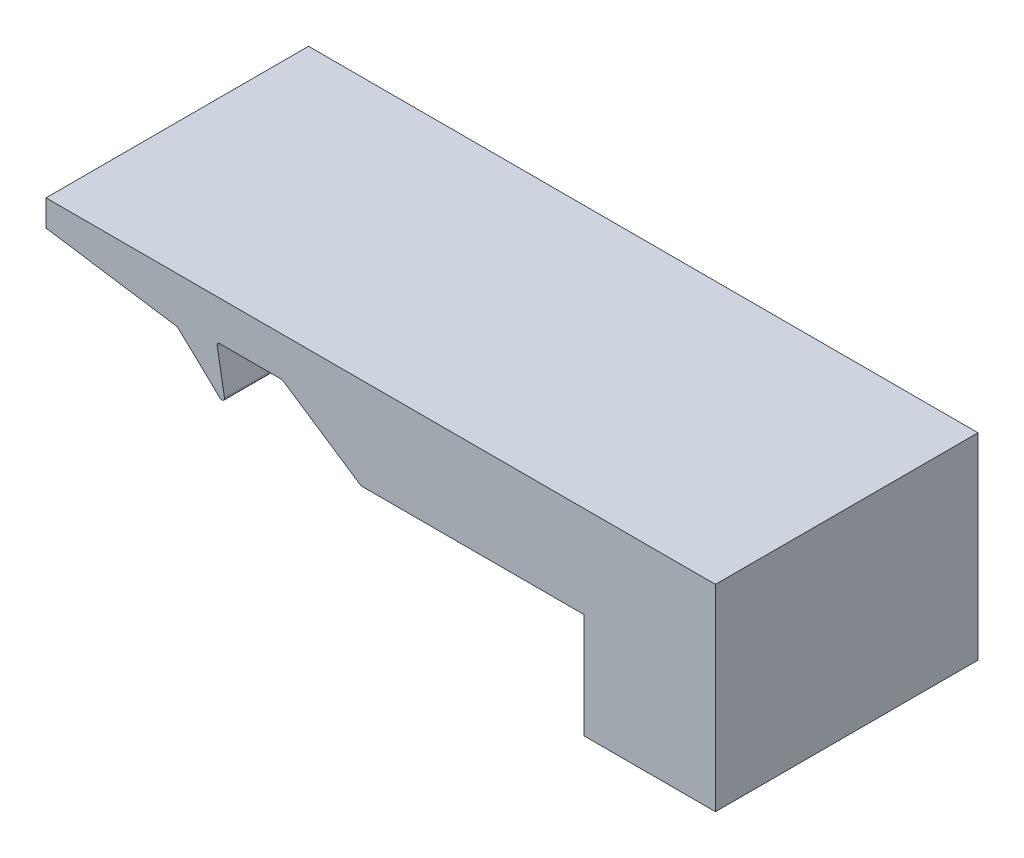
ISO-10303-21;
HEADER;
FILE_DESCRIPTION(('STEP AP214'),'2;1');
FILE_NAME('part.step','',(''),(''),'','','');
FILE_SCHEMA(('AUTOMOTIVE_DESIGN { 1 0 10303 214 1 1 1 1 }'));
ENDSEC;
DATA;
#1=APPLICATION_CONTEXT('core data for automotive mechanical design processes');
#2=APPLICATION_PROTOCOL_DEFINITION('international standard','automotive_design',2000,#1);
#3=PRODUCT_CONTEXT('',#1,'mechanical');
#4=PRODUCT('Part','Part','',(#3));
#5=PRODUCT_RELATED_PRODUCT_CATEGORY('part','',(#4));
#6=PRODUCT_DEFINITION_FORMATION('','',#4);
#7=PRODUCT_DEFINITION_CONTEXT('part definition',#1,'design');
#8=PRODUCT_DEFINITION('design','',#6,#7);
#9=PRODUCT_DEFINITION_SHAPE('','',#8);
#10=(LENGTH_UNIT() NAMED_UNIT(*) SI_UNIT(.MILLI.,.METRE.));
#11=(NAMED_UNIT(*) PLANE_ANGLE_UNIT() SI_UNIT($,.RADIAN.));
#12=(NAMED_UNIT(*) SI_UNIT($,.STERADIAN.) SOLID_ANGLE_UNIT());
#13=UNCERTAINTY_MEASURE_WITH_UNIT(LENGTH_MEASURE(1.E-05),#10,'distance_accuracy_value','');
#14=(GEOMETRIC_REPRESENTATION_CONTEXT(3) GLOBAL_UNCERTAINTY_ASSIGNED_CONTEXT((#13)) GLOBAL_UNIT_ASSIGNED_CONTEXT((#10,
#11,#12)) REPRESENTATION_CONTEXT('',''));
#15=CARTESIAN_POINT('',(0.,0.,0.));
#16=DIRECTION('',(0.,0.,1.));
#17=DIRECTION('',(1.,0.,0.));
#18=AXIS2_PLACEMENT_3D('',#15,#16,#17);
#19=CARTESIAN_POINT('',(-22.6448736499437,0.903160858228059,10.));
#20=DIRECTION('',(0.,1.,0.));
#21=DIRECTION('',(-1.,0.,0.));
#22=AXIS2_PLACEMENT_3D('',#19,#20,#21);
#23=PLANE('',#22);
#24=DIRECTION('',(1.,0.,0.));
#25=VECTOR('',#24,1.);
#26=CARTESIAN_POINT('',(-22.6448736499437,0.903160858228059,0.));
#27=LINE('',#26,#25);
#28=CARTESIAN_POINT('',(-31.1448736499437,0.903160858228059,0.));
#29=VERTEX_POINT('',#28);
#30=CARTESIAN_POINT('',(-22.6448736499437,0.903160858228059,0.));
#31=VERTEX_POINT('',#30);
#32=EDGE_CURVE('E173',#29,#31,#27,.T.);
#33=ORIENTED_EDGE('',*,*,#32,.T.);
#34=DIRECTION('',(0.,0.,-1.));
#35=VECTOR('',#34,1.);
#36=CARTESIAN_POINT('',(-22.6448736499437,0.903160858228059,10.));
#37=LINE('',#36,#35);
#38=CARTESIAN_POINT('',(-22.6448736499437,0.903160858228059,10.));
#39=VERTEX_POINT('',#38);
#40=EDGE_CURVE('E152',#39,#31,#37,.T.);
#41=ORIENTED_EDGE('',*,*,#40,.F.);
#42=DIRECTION('',(1.,0.,0.));
#43=VECTOR('',#42,1.);
#44=CARTESIAN_POINT('',(-22.6448736499437,0.903160858228059,10.));
#45=LINE('',#44,#43);
#46=CARTESIAN_POINT('',(-31.1448736499437,0.903160858228059,10.));
#47=VERTEX_POINT('',#46);
#48=EDGE_CURVE('E160',#47,#39,#45,.T.);
#49=ORIENTED_EDGE('',*,*,#48,.F.);
#50=DIRECTION('',(0.,0.,-1.));
#51=VECTOR('',#50,1.);
#52=CARTESIAN_POINT('',(-31.1448736499437,0.903160858228059,10.));
#53=LINE('',#52,#51);
#54=EDGE_CURVE('E243',#47,#29,#53,.T.);
#55=ORIENTED_EDGE('',*,*,#54,.T.);
#56=EDGE_LOOP('',(#33,#41,#49,#55));
#57=FACE_BOUND('',#56,.T.);
#58=ADVANCED_FACE('F45',(#57),#23,.F.);
#59=CARTESIAN_POINT('',(-22.6448736499437,-3.09683914177194,10.));
#60=DIRECTION('',(1.,0.,0.));
#61=DIRECTION('',(0.,0.,-1.));
#62=AXIS2_PLACEMENT_3D('',#59,#60,#61);
#63=PLANE('',#62);
#64=DIRECTION('',(0.,-1.,0.));
#65=VECTOR('',#64,1.);
#66=CARTESIAN_POINT('',(-22.6448736499437,-3.09683914177194,0.));
#67=LINE('',#66,#65);
#68=CARTESIAN_POINT('',(-22.6448736499437,-3.09683914177194,0.));
#69=VERTEX_POINT('',#68);
#70=EDGE_CURVE('E251',#31,#69,#67,.T.);
#71=ORIENTED_EDGE('',*,*,#70,.T.);
#72=DIRECTION('',(0.,0.,-1.));
#73=VECTOR('',#72,1.);
#74=CARTESIAN_POINT('',(-22.6448736499437,-3.09683914177194,10.));
#75=LINE('',#74,#73);
#76=CARTESIAN_POINT('',(-22.6448736499437,-3.09683914177194,10.));
#77=VERTEX_POINT('',#76);
#78=EDGE_CURVE('E155',#77,#69,#75,.T.);
#79=ORIENTED_EDGE('',*,*,#78,.F.);
#80=DIRECTION('',(0.,-1.,0.));
#81=VECTOR('',#80,1.);
#82=CARTESIAN_POINT('',(-22.6448736499437,-3.09683914177194,10.));
#83=LINE('',#82,#81);
#84=EDGE_CURVE('E148',#39,#77,#83,.T.);
#85=ORIENTED_EDGE('',*,*,#84,.F.);
#86=ORIENTED_EDGE('',*,*,#40,.T.);
#87=EDGE_LOOP('',(#71,#79,#85,#86));
#88=FACE_BOUND('',#87,.T.);
#89=ADVANCED_FACE('F150',(#88),#63,.F.);
#90=CARTESIAN_POINT('',(-17.6448736499437,-3.09683914177194,10.));
#91=DIRECTION('',(0.,1.,0.));
#92=DIRECTION('',(0.,0.,1.));
#93=AXIS2_PLACEMENT_3D('',#90,#91,#92);
#94=PLANE('',#93);
#95=DIRECTION('',(1.,0.,0.));
#96=VECTOR('',#95,1.);
#97=CARTESIAN_POINT('',(-17.6448736499437,-3.09683914177194,0.));
#98=LINE('',#97,#96);
#99=CARTESIAN_POINT('',(-17.6448736499437,-3.09683914177194,0.));
#100=VERTEX_POINT('',#99);
#101=EDGE_CURVE('E254',#69,#100,#98,.T.);
#102=ORIENTED_EDGE('',*,*,#101,.T.);
#103=DIRECTION('',(0.,0.,-1.));
#104=VECTOR('',#103,1.);
#105=CARTESIAN_POINT('',(-17.6448736499437,-3.09683914177194,10.));
#106=LINE('',#105,#104);
#107=CARTESIAN_POINT('',(-17.6448736499437,-3.09683914177194,10.));
#108=VERTEX_POINT('',#107);
#109=EDGE_CURVE('E182',#108,#100,#106,.T.);
#110=ORIENTED_EDGE('',*,*,#109,.F.);
#111=DIRECTION('',(1.,0.,0.));
#112=VECTOR('',#111,1.);
#113=CARTESIAN_POINT('',(-17.6448736499437,-3.09683914177194,10.));
#114=LINE('',#113,#112);
#115=EDGE_CURVE('E159',#77,#108,#114,.T.);
#116=ORIENTED_EDGE('',*,*,#115,.F.);
#117=ORIENTED_EDGE('',*,*,#78,.T.);
#118=EDGE_LOOP('',(#102,#110,#116,#117));
#119=FACE_BOUND('',#118,.T.);
#120=ADVANCED_FACE('F339',(#119),#94,.F.);
#121=CARTESIAN_POINT('',(-17.6448736499437,4.40316085822806,10.));
#122=DIRECTION('',(-1.,0.,0.));
#123=DIRECTION('',(0.,0.,1.));
#124=AXIS2_PLACEMENT_3D('',#121,#122,#123);
#125=PLANE('',#124);
#126=DIRECTION('',(0.,1.,0.));
#127=VECTOR('',#126,1.);
#128=CARTESIAN_POINT('',(-17.6448736499437,4.40316085822806,0.));
#129=LINE('',#128,#127);
#130=CARTESIAN_POINT('',(-17.6448736499437,4.40316085822806,0.));
#131=VERTEX_POINT('',#130);
#132=EDGE_CURVE('E257',#100,#131,#129,.T.);
#133=ORIENTED_EDGE('',*,*,#132,.T.);
#134=DIRECTION('',(0.,0.,-1.));
#135=VECTOR('',#134,1.);
#136=CARTESIAN_POINT('',(-17.6448736499437,4.40316085822806,10.));
#137=LINE('',#136,#135);
#138=CARTESIAN_POINT('',(-17.6448736499437,4.40316085822806,10.));
#139=VERTEX_POINT('',#138);
#140=EDGE_CURVE('E289',#139,#131,#137,.T.);
#141=ORIENTED_EDGE('',*,*,#140,.F.);
#142=DIRECTION('',(0.,1.,0.));
#143=VECTOR('',#142,1.);
#144=CARTESIAN_POINT('',(-17.6448736499437,4.40316085822806,10.));
#145=LINE('',#144,#143);
#146=EDGE_CURVE('E300',#108,#139,#145,.T.);
#147=ORIENTED_EDGE('',*,*,#146,.F.);
#148=ORIENTED_EDGE('',*,*,#109,.T.);
#149=EDGE_LOOP('',(#133,#141,#147,#148));
#150=FACE_BOUND('',#149,.T.);
#151=ADVANCED_FACE('F298',(#150),#125,.F.);
#152=CARTESIAN_POINT('',(-43.1448736499437,4.40316085822806,10.));
#153=DIRECTION('',(0.,-1.,0.));
#154=DIRECTION('',(1.,0.,0.));
#155=AXIS2_PLACEMENT_3D('',#152,#153,#154);
#156=PLANE('',#155);
#157=DIRECTION('',(-1.,0.,0.));
#158=VECTOR('',#157,1.);
#159=CARTESIAN_POINT('',(-43.1448736499437,4.40316085822806,0.));
#160=LINE('',#159,#158);
#161=CARTESIAN_POINT('',(-43.1448736499437,4.40316085822806,0.));
#162=VERTEX_POINT('',#161);
#163=EDGE_CURVE('E260',#131,#162,#160,.T.);
#164=ORIENTED_EDGE('',*,*,#163,.T.);
#165=DIRECTION('',(0.,0.,-1.));
#166=VECTOR('',#165,1.);
#167=CARTESIAN_POINT('',(-43.1448736499437,4.40316085822806,10.));
#168=LINE('',#167,#166);
#169=CARTESIAN_POINT('',(-43.1448736499437,4.40316085822806,10.));
#170=VERTEX_POINT('',#169);
#171=EDGE_CURVE('E285',#170,#162,#168,.T.);
#172=ORIENTED_EDGE('',*,*,#171,.F.);
#173=DIRECTION('',(-1.,0.,0.));
#174=VECTOR('',#173,1.);
#175=CARTESIAN_POINT('',(-43.1448736499437,4.40316085822806,10.));
#176=LINE('',#175,#174);
#177=EDGE_CURVE('E318',#139,#170,#176,.T.);
#178=ORIENTED_EDGE('',*,*,#177,.F.);
#179=ORIENTED_EDGE('',*,*,#140,.T.);
#180=EDGE_LOOP('',(#164,#172,#178,#179));
#181=FACE_BOUND('',#180,.T.);
#182=ADVANCED_FACE('F308',(#181),#156,.F.);
#183=CARTESIAN_POINT('',(-43.1448736499437,4.40316085822806,10.));
#184=DIRECTION('',(1.,0.,0.));
#185=DIRECTION('',(0.,0.,-1.));
#186=AXIS2_PLACEMENT_3D('',#183,#184,#185);
#187=PLANE('',#186);
#188=DIRECTION('',(0.,-1.,0.));
#189=VECTOR('',#188,1.);
#190=CARTESIAN_POINT('',(-43.1448736499437,4.40316085822806,0.));
#191=LINE('',#190,#189);
#192=CARTESIAN_POINT('',(-43.1448736499437,3.40316085822806,0.));
#193=VERTEX_POINT('',#192);
#194=EDGE_CURVE('E263',#162,#193,#191,.T.);
#195=ORIENTED_EDGE('',*,*,#194,.T.);
#196=DIRECTION('',(0.,0.,-1.));
#197=VECTOR('',#196,1.);
#198=CARTESIAN_POINT('',(-43.1448736499437,3.40316085822806,10.));
#199=LINE('',#198,#197);
#200=CARTESIAN_POINT('',(-43.1448736499437,3.40316085822806,10.));
#201=VERTEX_POINT('',#200);
#202=EDGE_CURVE('E281',#201,#193,#199,.T.);
#203=ORIENTED_EDGE('',*,*,#202,.F.);
#204=DIRECTION('',(0.,-1.,0.));
#205=VECTOR('',#204,1.);
#206=CARTESIAN_POINT('',(-43.1448736499437,4.40316085822806,10.));
#207=LINE('',#206,#205);
#208=EDGE_CURVE('E314',#170,#201,#207,.T.);
#209=ORIENTED_EDGE('',*,*,#208,.F.);
#210=ORIENTED_EDGE('',*,*,#171,.T.);
#211=EDGE_LOOP('',(#195,#203,#209,#210));
#212=FACE_BOUND('',#211,.T.);
#213=ADVANCED_FACE('F312',(#212),#187,.F.);
#214=CARTESIAN_POINT('',(-43.1448736499437,3.40316085822806,10.));
#215=DIRECTION('',(0.148340452930245,0.988936352868297,0.));
#216=DIRECTION('',(-0.988936352868298,0.148340452930245,0.));
#217=AXIS2_PLACEMENT_3D('',#214,#215,#216);
#218=PLANE('',#217);
#219=DIRECTION('',(0.988936352868298,-0.148340452930245,0.));
#220=VECTOR('',#219,1.);
#221=CARTESIAN_POINT('',(-43.1448736499437,3.40316085822806,0.));
#222=LINE('',#221,#220);
#223=CARTESIAN_POINT('',(-38.1448736499437,2.65316085822806,0.));
#224=VERTEX_POINT('',#223);
#225=EDGE_CURVE('E266',#193,#224,#222,.T.);
#226=ORIENTED_EDGE('',*,*,#225,.T.);
#227=DIRECTION('',(0.,0.,-1.));
#228=VECTOR('',#227,1.);
#229=CARTESIAN_POINT('',(-38.1448736499437,2.65316085822806,10.));
#230=LINE('',#229,#228);
#231=CARTESIAN_POINT('',(-38.1448736499437,2.65316085822806,10.));
#232=VERTEX_POINT('',#231);
#233=EDGE_CURVE('E277',#232,#224,#230,.T.);
#234=ORIENTED_EDGE('',*,*,#233,.F.);
#235=DIRECTION('',(0.988936352868298,-0.148340452930245,0.));
#236=VECTOR('',#235,1.);
#237=CARTESIAN_POINT('',(-43.1448736499437,3.40316085822806,10.));
#238=LINE('',#237,#236);
#239=EDGE_CURVE('E317',#201,#232,#238,.T.);
#240=ORIENTED_EDGE('',*,*,#239,.F.);
#241=ORIENTED_EDGE('',*,*,#202,.T.);
#242=EDGE_LOOP('',(#226,#234,#240,#241));
#243=FACE_BOUND('',#242,.T.);
#244=ADVANCED_FACE('F366',(#243),#218,.F.);
#245=CARTESIAN_POINT('',(-38.1448736499437,2.65316085822806,10.));
#246=DIRECTION('',(0.687098329534195,0.726564440054232,0.));
#247=DIRECTION('',(-0.726564440054232,0.687098329534195,0.));
#248=AXIS2_PLACEMENT_3D('',#245,#246,#247);
#249=PLANE('',#248);
#250=DIRECTION('',(0.726564440054232,-0.687098329534195,0.));
#251=VECTOR('',#250,1.);
#252=CARTESIAN_POINT('',(-38.1448736499437,2.65316085822806,0.));
#253=LINE('',#252,#251);
#254=CARTESIAN_POINT('',(-36.5136728496177,1.11056493245556,0.));
#255=VERTEX_POINT('',#254);
#256=EDGE_CURVE('E227',#224,#255,#253,.T.);
#257=ORIENTED_EDGE('',*,*,#256,.T.);
#258=DIRECTION('',(0.,0.,-1.));
#259=VECTOR('',#258,1.);
#260=CARTESIAN_POINT('',(-36.5136728496177,1.11056493245556,10.));
#261=LINE('',#260,#259);
#262=CARTESIAN_POINT('',(-36.5136728496177,1.11056493245556,10.));
#263=VERTEX_POINT('',#262);
#264=EDGE_CURVE('E61',#255,#263,#261,.F.);
#265=ORIENTED_EDGE('',*,*,#264,.T.);
#266=DIRECTION('',(0.726564440054232,-0.687098329534195,0.));
#267=VECTOR('',#266,1.);
#268=CARTESIAN_POINT('',(-38.1448736499437,2.65316085822806,10.));
#269=LINE('',#268,#267);
#270=EDGE_CURVE('E245',#232,#263,#269,.T.);
#271=ORIENTED_EDGE('',*,*,#270,.F.);
#272=ORIENTED_EDGE('',*,*,#233,.T.);
#273=EDGE_LOOP('',(#257,#265,#271,#272));
#274=FACE_BOUND('',#273,.T.);
#275=ADVANCED_FACE('F369',(#274),#249,.F.);
#276=CARTESIAN_POINT('',(-36.2943557321416,0.903160858228058,10.));
#277=DIRECTION('',(-0.984987125008186,-0.172627818059862,0.));
#278=DIRECTION('',(0.172627818059862,-0.984987125008186,0.));
#279=AXIS2_PLACEMENT_3D('',#276,#277,#278);
#280=PLANE('',#279);
#281=DIRECTION('',(-0.172627818059862,0.984987125008186,0.));
#282=VECTOR('',#281,1.);
#283=CARTESIAN_POINT('',(-36.2943557321416,0.903160858228058,0.));
#284=LINE('',#283,#282);
#285=CARTESIAN_POINT('',(-36.3464643041635,1.20048415826697,0.));
#286=VERTEX_POINT('',#285);
#287=CARTESIAN_POINT('',(-36.6243222968866,2.78589807642207,0.));
#288=VERTEX_POINT('',#287);
#289=EDGE_CURVE('E215',#286,#288,#284,.T.);
#290=ORIENTED_EDGE('',*,*,#289,.T.);
#291=DIRECTION('',(0.,0.,-1.));
#292=VECTOR('',#291,1.);
#293=CARTESIAN_POINT('',(-36.6243222968866,2.78589807642207,10.));
#294=LINE('',#293,#292);
#295=CARTESIAN_POINT('',(-36.6243222968866,2.78589807642207,10.));
#296=VERTEX_POINT('',#295);
#297=EDGE_CURVE('E196',#288,#296,#294,.F.);
#298=ORIENTED_EDGE('',*,*,#297,.T.);
#299=DIRECTION('',(-0.172627818059862,0.984987125008186,0.));
#300=VECTOR('',#299,1.);
#301=CARTESIAN_POINT('',(-36.2943557321416,0.903160858228058,10.));
#302=LINE('',#301,#300);
#303=CARTESIAN_POINT('',(-36.3464643041635,1.20048415826697,10.));
#304=VERTEX_POINT('',#303);
#305=EDGE_CURVE('E235',#304,#296,#302,.T.);
#306=ORIENTED_EDGE('',*,*,#305,.F.);
#307=DIRECTION('',(0.,0.,-1.));
#308=VECTOR('',#307,1.);
#309=CARTESIAN_POINT('',(-36.3464643041635,1.20048415826697,10.));
#310=LINE('',#309,#308);
#311=EDGE_CURVE('E192',#304,#286,#310,.T.);
#312=ORIENTED_EDGE('',*,*,#311,.T.);
#313=EDGE_LOOP('',(#290,#298,#306,#312));
#314=FACE_BOUND('',#313,.T.);
#315=ADVANCED_FACE('F222',(#314),#280,.F.);
#316=CARTESIAN_POINT('',(-34.1448736499437,2.90316085822806,10.));
#317=DIRECTION('',(0.,1.,0.));
#318=DIRECTION('',(0.,0.,1.));
#319=AXIS2_PLACEMENT_3D('',#316,#317,#318);
#320=PLANE('',#319);
#321=DIRECTION('',(1.,0.,0.));
#322=VECTOR('',#321,1.);
#323=CARTESIAN_POINT('',(-34.1448736499437,2.90316085822806,0.));
#324=LINE('',#323,#322);
#325=CARTESIAN_POINT('',(-36.5258235843857,2.90316085822806,0.));
#326=VERTEX_POINT('',#325);
#327=CARTESIAN_POINT('',(-34.1751512137169,2.90316085822806,0.));
#328=VERTEX_POINT('',#327);
#329=EDGE_CURVE('E217',#326,#328,#324,.T.);
#330=ORIENTED_EDGE('',*,*,#329,.T.);
#331=DIRECTION('',(0.,0.,-1.));
#332=VECTOR('',#331,1.);
#333=CARTESIAN_POINT('',(-34.1751512137169,2.90316085822806,10.));
#334=LINE('',#333,#332);
#335=CARTESIAN_POINT('',(-34.1751512137169,2.90316085822806,10.));
#336=VERTEX_POINT('',#335);
#337=EDGE_CURVE('E189',#328,#336,#334,.F.);
#338=ORIENTED_EDGE('',*,*,#337,.T.);
#339=DIRECTION('',(1.,0.,0.));
#340=VECTOR('',#339,1.);
#341=CARTESIAN_POINT('',(-34.1448736499437,2.90316085822806,10.));
#342=LINE('',#341,#340);
#343=CARTESIAN_POINT('',(-36.5258235843857,2.90316085822806,10.));
#344=VERTEX_POINT('',#343);
#345=EDGE_CURVE('E233',#344,#336,#342,.T.);
#346=ORIENTED_EDGE('',*,*,#345,.F.);
#347=DIRECTION('',(0.,0.,-1.));
#348=VECTOR('',#347,1.);
#349=CARTESIAN_POINT('',(-36.5258235843857,2.90316085822806,0.));
#350=LINE('',#349,#348);
#351=EDGE_CURVE('E180',#344,#326,#350,.T.);
#352=ORIENTED_EDGE('',*,*,#351,.T.);
#353=EDGE_LOOP('',(#330,#338,#346,#352));
#354=FACE_BOUND('',#353,.T.);
#355=ADVANCED_FACE('F237',(#354),#320,.F.);
#356=CARTESIAN_POINT('',(-31.1448736499437,0.903160858228059,10.));
#357=DIRECTION('',(0.554700196225229,0.832050294337844,0.));
#358=DIRECTION('',(-0.832050294337844,0.554700196225229,0.));
#359=AXIS2_PLACEMENT_3D('',#356,#357,#358);
#360=PLANE('',#359);
#361=DIRECTION('',(0.832050294337844,-0.554700196225229,0.));
#362=VECTOR('',#361,1.);
#363=CARTESIAN_POINT('',(-31.1448736499437,0.903160858228059,10.));
#364=LINE('',#363,#362);
#365=CARTESIAN_POINT('',(-34.1196811940944,2.88636588766185,10.));
#366=VERTEX_POINT('',#365);
#367=EDGE_CURVE('E165',#366,#47,#364,.T.);
#368=ORIENTED_EDGE('',*,*,#367,.F.);
#369=DIRECTION('',(0.,0.,-1.));
#370=VECTOR('',#369,1.);
#371=CARTESIAN_POINT('',(-34.1196811940944,2.88636588766185,0.));
#372=LINE('',#371,#370);
#373=CARTESIAN_POINT('',(-34.1196811940944,2.88636588766185,0.));
#374=VERTEX_POINT('',#373);
#375=EDGE_CURVE('E175',#366,#374,#372,.T.);
#376=ORIENTED_EDGE('',*,*,#375,.T.);
#377=DIRECTION('',(0.832050294337844,-0.554700196225229,0.));
#378=VECTOR('',#377,1.);
#379=CARTESIAN_POINT('',(-31.1448736499437,0.903160858228059,0.));
#380=LINE('',#379,#378);
#381=EDGE_CURVE('E170',#374,#29,#380,.T.);
#382=ORIENTED_EDGE('',*,*,#381,.T.);
#383=ORIENTED_EDGE('',*,*,#54,.F.);
#384=EDGE_LOOP('',(#368,#376,#382,#383));
#385=FACE_BOUND('',#384,.T.);
#386=ADVANCED_FACE('F351',(#385),#360,.F.);
#387=CARTESIAN_POINT('',(0.,0.,10.));
#388=DIRECTION('',(0.,0.,1.));
#389=DIRECTION('',(1.,0.,0.));
#390=AXIS2_PLACEMENT_3D('',#387,#388,#389);
#391=PLANE('',#390);
#392=ORIENTED_EDGE('',*,*,#270,.T.);
#393=CARTESIAN_POINT('',(-36.4449630166643,1.18322137646098,10.));
#394=DIRECTION('',(0.,0.,1.));
#395=DIRECTION('',(1.,0.,0.));
#396=AXIS2_PLACEMENT_3D('',#393,#394,#395);
#397=CIRCLE('',#396,0.1);
#398=EDGE_CURVE('E203',#263,#304,#397,.T.);
#399=ORIENTED_EDGE('',*,*,#398,.T.);
#400=ORIENTED_EDGE('',*,*,#305,.T.);
#401=CARTESIAN_POINT('',(-36.5258235843857,2.80316085822806,10.));
#402=DIRECTION('',(0.,0.,1.));
#403=DIRECTION('',(1.,0.,0.));
#404=AXIS2_PLACEMENT_3D('',#401,#402,#403);
#405=CIRCLE('',#404,0.1);
#406=EDGE_CURVE('E11',#296,#344,#405,.F.);
#407=ORIENTED_EDGE('',*,*,#406,.T.);
#408=ORIENTED_EDGE('',*,*,#345,.T.);
#409=CARTESIAN_POINT('',(-34.1751512137169,2.80316085822806,10.));
#410=DIRECTION('',(0.,0.,1.));
#411=DIRECTION('',(1.,0.,0.));
#412=AXIS2_PLACEMENT_3D('',#409,#410,#411);
#413=CIRCLE('',#412,0.1);
#414=EDGE_CURVE('E209',#336,#366,#413,.F.);
#415=ORIENTED_EDGE('',*,*,#414,.T.);
#416=ORIENTED_EDGE('',*,*,#367,.T.);
#417=ORIENTED_EDGE('',*,*,#48,.T.);
#418=ORIENTED_EDGE('',*,*,#84,.T.);
#419=ORIENTED_EDGE('',*,*,#115,.T.);
#420=ORIENTED_EDGE('',*,*,#146,.T.);
#421=ORIENTED_EDGE('',*,*,#177,.T.);
#422=ORIENTED_EDGE('',*,*,#208,.T.);
#423=ORIENTED_EDGE('',*,*,#239,.T.);
#424=EDGE_LOOP('',(#392,#399,#400,#407,#408,#415,#416,#417,#418,#419,#420,#421,#422,#423));
#425=FACE_BOUND('',#424,.T.);
#426=ADVANCED_FACE('F163',(#425),#391,.T.);
#427=CARTESIAN_POINT('',(0.,0.,0.));
#428=DIRECTION('',(0.,0.,1.));
#429=DIRECTION('',(1.,0.,0.));
#430=AXIS2_PLACEMENT_3D('',#427,#428,#429);
#431=PLANE('',#430);
#432=ORIENTED_EDGE('',*,*,#289,.F.);
#433=CARTESIAN_POINT('',(-36.4449630166643,1.18322137646098,0.));
#434=DIRECTION('',(0.,0.,1.));
#435=DIRECTION('',(1.,0.,0.));
#436=AXIS2_PLACEMENT_3D('',#433,#434,#435);
#437=CIRCLE('',#436,0.1);
#438=EDGE_CURVE('E69',#286,#255,#437,.F.);
#439=ORIENTED_EDGE('',*,*,#438,.T.);
#440=ORIENTED_EDGE('',*,*,#256,.F.);
#441=ORIENTED_EDGE('',*,*,#225,.F.);
#442=ORIENTED_EDGE('',*,*,#194,.F.);
#443=ORIENTED_EDGE('',*,*,#163,.F.);
#444=ORIENTED_EDGE('',*,*,#132,.F.);
#445=ORIENTED_EDGE('',*,*,#101,.F.);
#446=ORIENTED_EDGE('',*,*,#70,.F.);
#447=ORIENTED_EDGE('',*,*,#32,.F.);
#448=ORIENTED_EDGE('',*,*,#381,.F.);
#449=CARTESIAN_POINT('',(-34.1751512137169,2.80316085822806,0.));
#450=DIRECTION('',(0.,0.,1.));
#451=DIRECTION('',(1.,0.,0.));
#452=AXIS2_PLACEMENT_3D('',#449,#450,#451);
#453=CIRCLE('',#452,0.1);
#454=EDGE_CURVE('E206',#374,#328,#453,.T.);
#455=ORIENTED_EDGE('',*,*,#454,.T.);
#456=ORIENTED_EDGE('',*,*,#329,.F.);
#457=CARTESIAN_POINT('',(-36.5258235843857,2.80316085822806,0.));
#458=DIRECTION('',(0.,0.,1.));
#459=DIRECTION('',(1.,0.,0.));
#460=AXIS2_PLACEMENT_3D('',#457,#458,#459);
#461=CIRCLE('',#460,0.1);
#462=EDGE_CURVE('E54',#326,#288,#461,.T.);
#463=ORIENTED_EDGE('',*,*,#462,.T.);
#464=EDGE_LOOP('',(#432,#439,#440,#441,#442,#443,#444,#445,#446,#447,#448,#455,#456,#463));
#465=FACE_BOUND('',#464,.T.);
#466=ADVANCED_FACE('F214',(#465),#431,.F.);
#467=CARTESIAN_POINT('',(-34.1751512137169,2.80316085822806,10.));
#468=DIRECTION('',(0.,0.,1.));
#469=DIRECTION('',(1.,0.,0.));
#470=AXIS2_PLACEMENT_3D('',#467,#468,#469);
#471=CYLINDRICAL_SURFACE('',#470,0.1);
#472=ORIENTED_EDGE('',*,*,#414,.F.);
#473=ORIENTED_EDGE('',*,*,#337,.F.);
#474=ORIENTED_EDGE('',*,*,#454,.F.);
#475=ORIENTED_EDGE('',*,*,#375,.F.);
#476=EDGE_LOOP('',(#472,#473,#474,#475));
#477=FACE_BOUND('',#476,.T.);
#478=ADVANCED_FACE('F333',(#477),#471,.F.);
#479=CARTESIAN_POINT('',(-36.5258235843857,2.80316085822806,10.));
#480=DIRECTION('',(0.,0.,1.));
#481=DIRECTION('',(1.,0.,0.));
#482=AXIS2_PLACEMENT_3D('',#479,#480,#481);
#483=CYLINDRICAL_SURFACE('',#482,0.1);
#484=ORIENTED_EDGE('',*,*,#406,.F.);
#485=ORIENTED_EDGE('',*,*,#297,.F.);
#486=ORIENTED_EDGE('',*,*,#462,.F.);
#487=ORIENTED_EDGE('',*,*,#351,.F.);
#488=EDGE_LOOP('',(#484,#485,#486,#487));
#489=FACE_BOUND('',#488,.T.);
#490=ADVANCED_FACE('F230',(#489),#483,.F.);
#491=CARTESIAN_POINT('',(-36.4449630166643,1.18322137646098,10.));
#492=DIRECTION('',(0.,0.,-1.));
#493=DIRECTION('',(-1.,0.,0.));
#494=AXIS2_PLACEMENT_3D('',#491,#492,#493);
#495=CYLINDRICAL_SURFACE('',#494,0.1);
#496=ORIENTED_EDGE('',*,*,#398,.F.);
#497=ORIENTED_EDGE('',*,*,#264,.F.);
#498=ORIENTED_EDGE('',*,*,#438,.F.);
#499=ORIENTED_EDGE('',*,*,#311,.F.);
#500=EDGE_LOOP('',(#496,#497,#498,#499));
#501=FACE_BOUND('',#500,.T.);
#502=ADVANCED_FACE('F47',(#501),#495,.T.);
#503=CLOSED_SHELL('',(#58,#89,#120,#151,#182,#213,#244,#275,#315,#355,#386,#426,#466,#478,#490,#502));
#504=MANIFOLD_SOLID_BREP('B2',#503);
#505=ADVANCED_BREP_SHAPE_REPRESENTATION('',(#18,#504),#14);
#506=SHAPE_DEFINITION_REPRESENTATION(#9,#505);
ENDSEC;
END-ISO-10303-21;
